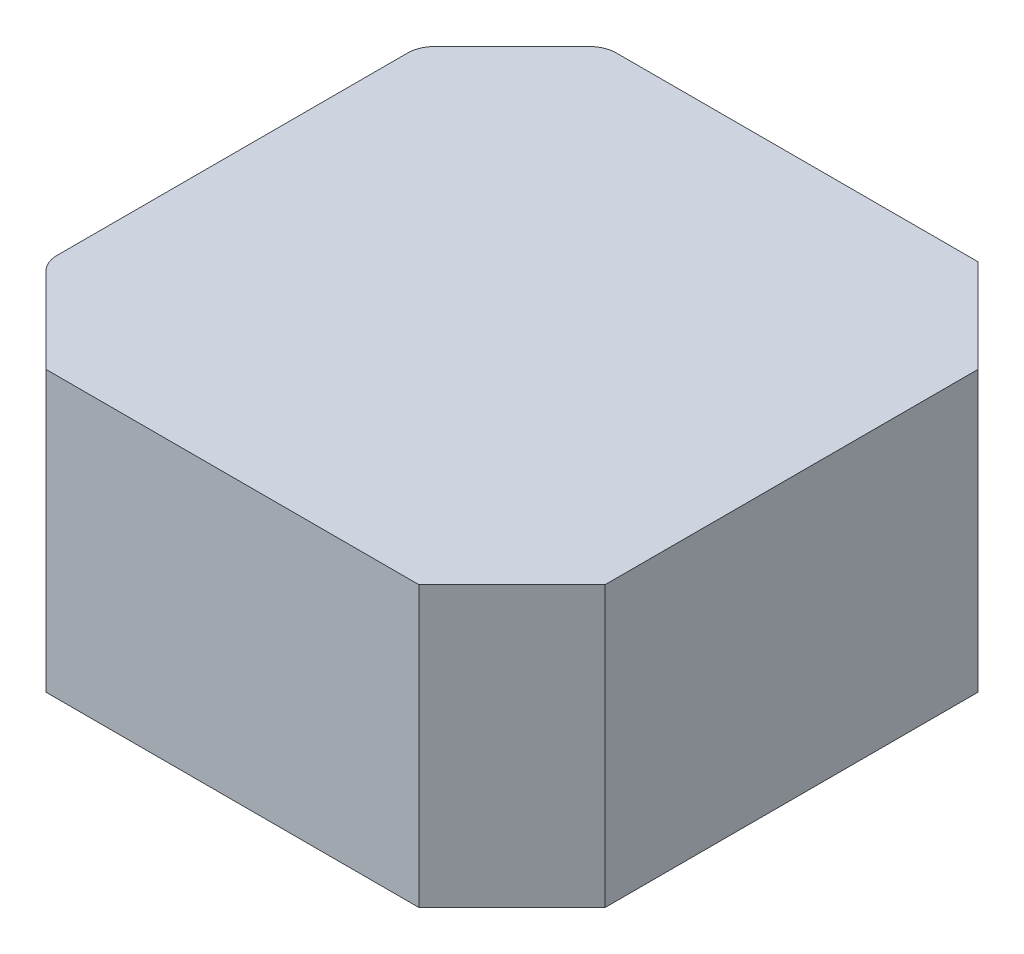
ISO-10303-21;
HEADER;
FILE_DESCRIPTION(('STEP AP214'),'2;1');
FILE_NAME('part.step','',(''),(''),'','','');
FILE_SCHEMA(('AUTOMOTIVE_DESIGN { 1 0 10303 214 1 1 1 1 }'));
ENDSEC;
DATA;
#1=APPLICATION_CONTEXT('core data for automotive mechanical design processes');
#2=APPLICATION_PROTOCOL_DEFINITION('international standard','automotive_design',2000,#1);
#3=PRODUCT_CONTEXT('',#1,'mechanical');
#4=PRODUCT('Part','Part','',(#3));
#5=PRODUCT_RELATED_PRODUCT_CATEGORY('part','',(#4));
#6=PRODUCT_DEFINITION_FORMATION('','',#4);
#7=PRODUCT_DEFINITION_CONTEXT('part definition',#1,'design');
#8=PRODUCT_DEFINITION('design','',#6,#7);
#9=PRODUCT_DEFINITION_SHAPE('','',#8);
#10=(LENGTH_UNIT() NAMED_UNIT(*) SI_UNIT(.MILLI.,.METRE.));
#11=(NAMED_UNIT(*) PLANE_ANGLE_UNIT() SI_UNIT($,.RADIAN.));
#12=(NAMED_UNIT(*) SI_UNIT($,.STERADIAN.) SOLID_ANGLE_UNIT());
#13=UNCERTAINTY_MEASURE_WITH_UNIT(LENGTH_MEASURE(1.E-05),#10,'distance_accuracy_value','');
#14=(GEOMETRIC_REPRESENTATION_CONTEXT(3) GLOBAL_UNCERTAINTY_ASSIGNED_CONTEXT((#13)) GLOBAL_UNIT_ASSIGNED_CONTEXT((#10,
#11,#12)) REPRESENTATION_CONTEXT('',''));
#15=CARTESIAN_POINT('',(0.,0.,0.));
#16=DIRECTION('',(0.,0.,1.));
#17=DIRECTION('',(1.,0.,0.));
#18=AXIS2_PLACEMENT_3D('',#15,#16,#17);
#19=CARTESIAN_POINT('',(-21.,21.,-21.));
#20=DIRECTION('',(1.,0.,0.));
#21=DIRECTION('',(0.,0.,-1.));
#22=AXIS2_PLACEMENT_3D('',#19,#20,#21);
#23=PLANE('',#22);
#24=DIRECTION('',(0.,0.,1.));
#25=VECTOR('',#24,1.);
#26=CARTESIAN_POINT('',(-21.,21.,-21.));
#27=LINE('',#26,#25);
#28=CARTESIAN_POINT('',(-21.,21.,-13.1715728752538));
#29=VERTEX_POINT('',#28);
#30=CARTESIAN_POINT('',(-21.,21.,13.1715728752538));
#31=VERTEX_POINT('',#30);
#32=EDGE_CURVE('E143',#29,#31,#27,.T.);
#33=ORIENTED_EDGE('',*,*,#32,.F.);
#34=DIRECTION('',(0.,1.,0.));
#35=VECTOR('',#34,1.);
#36=CARTESIAN_POINT('',(-21.,0.,-13.1715728752538));
#37=LINE('',#36,#35);
#38=CARTESIAN_POINT('',(-21.,0.,-13.1715728752538));
#39=VERTEX_POINT('',#38);
#40=EDGE_CURVE('E41',#29,#39,#37,.F.);
#41=ORIENTED_EDGE('',*,*,#40,.T.);
#42=DIRECTION('',(0.,0.,1.));
#43=VECTOR('',#42,1.);
#44=CARTESIAN_POINT('',(-21.,0.,-21.));
#45=LINE('',#44,#43);
#46=CARTESIAN_POINT('',(-21.,0.,13.1715728752538));
#47=VERTEX_POINT('',#46);
#48=EDGE_CURVE('E196',#39,#47,#45,.T.);
#49=ORIENTED_EDGE('',*,*,#48,.T.);
#50=DIRECTION('',(0.,-1.,0.));
#51=VECTOR('',#50,1.);
#52=CARTESIAN_POINT('',(-21.,21.,13.1715728752538));
#53=LINE('',#52,#51);
#54=EDGE_CURVE('E190',#47,#31,#53,.F.);
#55=ORIENTED_EDGE('',*,*,#54,.T.);
#56=EDGE_LOOP('',(#33,#41,#49,#55));
#57=FACE_BOUND('',#56,.T.);
#58=ADVANCED_FACE('F33',(#57),#23,.F.);
#59=CARTESIAN_POINT('',(-21.,21.,21.));
#60=DIRECTION('',(0.,0.,-1.));
#61=DIRECTION('',(-1.,0.,0.));
#62=AXIS2_PLACEMENT_3D('',#59,#60,#61);
#63=PLANE('',#62);
#64=DIRECTION('',(1.,0.,0.));
#65=VECTOR('',#64,1.);
#66=CARTESIAN_POINT('',(-21.,21.,21.));
#67=LINE('',#66,#65);
#68=CARTESIAN_POINT('',(-14.,21.,21.));
#69=VERTEX_POINT('',#68);
#70=CARTESIAN_POINT('',(14.,21.,21.));
#71=VERTEX_POINT('',#70);
#72=EDGE_CURVE('E147',#69,#71,#67,.T.);
#73=ORIENTED_EDGE('',*,*,#72,.F.);
#74=DIRECTION('',(0.,-1.,0.));
#75=VECTOR('',#74,1.);
#76=CARTESIAN_POINT('',(-14.,21.,21.));
#77=LINE('',#76,#75);
#78=CARTESIAN_POINT('',(-14.,0.,21.));
#79=VERTEX_POINT('',#78);
#80=EDGE_CURVE('E167',#69,#79,#77,.T.);
#81=ORIENTED_EDGE('',*,*,#80,.T.);
#82=DIRECTION('',(1.,0.,0.));
#83=VECTOR('',#82,1.);
#84=CARTESIAN_POINT('',(-21.,0.,21.));
#85=LINE('',#84,#83);
#86=CARTESIAN_POINT('',(14.,0.,21.));
#87=VERTEX_POINT('',#86);
#88=EDGE_CURVE('E149',#79,#87,#85,.T.);
#89=ORIENTED_EDGE('',*,*,#88,.T.);
#90=DIRECTION('',(0.,1.,0.));
#91=VECTOR('',#90,1.);
#92=CARTESIAN_POINT('',(14.,21.,21.));
#93=LINE('',#92,#91);
#94=EDGE_CURVE('E165',#87,#71,#93,.T.);
#95=ORIENTED_EDGE('',*,*,#94,.T.);
#96=EDGE_LOOP('',(#73,#81,#89,#95));
#97=FACE_BOUND('',#96,.T.);
#98=ADVANCED_FACE('F223',(#97),#63,.F.);
#99=CARTESIAN_POINT('',(21.,21.,-21.));
#100=DIRECTION('',(-1.,0.,0.));
#101=DIRECTION('',(0.,0.,1.));
#102=AXIS2_PLACEMENT_3D('',#99,#100,#101);
#103=PLANE('',#102);
#104=DIRECTION('',(0.,0.,-1.));
#105=VECTOR('',#104,1.);
#106=CARTESIAN_POINT('',(21.,21.,-21.));
#107=LINE('',#106,#105);
#108=CARTESIAN_POINT('',(21.,21.,14.));
#109=VERTEX_POINT('',#108);
#110=CARTESIAN_POINT('',(21.,21.,-14.));
#111=VERTEX_POINT('',#110);
#112=EDGE_CURVE('E205',#109,#111,#107,.T.);
#113=ORIENTED_EDGE('',*,*,#112,.F.);
#114=DIRECTION('',(0.,-1.,0.));
#115=VECTOR('',#114,1.);
#116=CARTESIAN_POINT('',(21.,21.,14.));
#117=LINE('',#116,#115);
#118=CARTESIAN_POINT('',(21.,0.,14.));
#119=VERTEX_POINT('',#118);
#120=EDGE_CURVE('E171',#109,#119,#117,.T.);
#121=ORIENTED_EDGE('',*,*,#120,.T.);
#122=DIRECTION('',(0.,0.,-1.));
#123=VECTOR('',#122,1.);
#124=CARTESIAN_POINT('',(21.,0.,-21.));
#125=LINE('',#124,#123);
#126=CARTESIAN_POINT('',(21.,0.,-14.));
#127=VERTEX_POINT('',#126);
#128=EDGE_CURVE('E144',#119,#127,#125,.T.);
#129=ORIENTED_EDGE('',*,*,#128,.T.);
#130=DIRECTION('',(0.,1.,0.));
#131=VECTOR('',#130,1.);
#132=CARTESIAN_POINT('',(21.,21.,-14.));
#133=LINE('',#132,#131);
#134=EDGE_CURVE('E121',#127,#111,#133,.T.);
#135=ORIENTED_EDGE('',*,*,#134,.T.);
#136=EDGE_LOOP('',(#113,#121,#129,#135));
#137=FACE_BOUND('',#136,.T.);
#138=ADVANCED_FACE('F221',(#137),#103,.F.);
#139=CARTESIAN_POINT('',(-21.,21.,-21.));
#140=DIRECTION('',(0.,0.,1.));
#141=DIRECTION('',(1.,0.,0.));
#142=AXIS2_PLACEMENT_3D('',#139,#140,#141);
#143=PLANE('',#142);
#144=DIRECTION('',(-1.,0.,0.));
#145=VECTOR('',#144,1.);
#146=CARTESIAN_POINT('',(-21.,0.,-21.));
#147=LINE('',#146,#145);
#148=CARTESIAN_POINT('',(14.,0.,-21.));
#149=VERTEX_POINT('',#148);
#150=CARTESIAN_POINT('',(-13.1715728752538,0.,-21.));
#151=VERTEX_POINT('',#150);
#152=EDGE_CURVE('E133',#149,#151,#147,.T.);
#153=ORIENTED_EDGE('',*,*,#152,.T.);
#154=DIRECTION('',(0.,-1.,0.));
#155=VECTOR('',#154,1.);
#156=CARTESIAN_POINT('',(-13.1715728752538,21.,-21.));
#157=LINE('',#156,#155);
#158=CARTESIAN_POINT('',(-13.1715728752538,21.,-21.));
#159=VERTEX_POINT('',#158);
#160=EDGE_CURVE('E174',#151,#159,#157,.F.);
#161=ORIENTED_EDGE('',*,*,#160,.T.);
#162=DIRECTION('',(-1.,0.,0.));
#163=VECTOR('',#162,1.);
#164=CARTESIAN_POINT('',(-21.,21.,-21.));
#165=LINE('',#164,#163);
#166=CARTESIAN_POINT('',(14.,21.,-21.));
#167=VERTEX_POINT('',#166);
#168=EDGE_CURVE('E126',#167,#159,#165,.T.);
#169=ORIENTED_EDGE('',*,*,#168,.F.);
#170=DIRECTION('',(0.,-1.,0.));
#171=VECTOR('',#170,1.);
#172=CARTESIAN_POINT('',(14.,21.,-21.));
#173=LINE('',#172,#171);
#174=EDGE_CURVE('E120',#167,#149,#173,.T.);
#175=ORIENTED_EDGE('',*,*,#174,.T.);
#176=EDGE_LOOP('',(#153,#161,#169,#175));
#177=FACE_BOUND('',#176,.T.);
#178=ADVANCED_FACE('F131',(#177),#143,.F.);
#179=CARTESIAN_POINT('',(-21.,21.,21.));
#180=DIRECTION('',(0.,1.,0.));
#181=DIRECTION('',(0.,0.,1.));
#182=AXIS2_PLACEMENT_3D('',#179,#180,#181);
#183=PLANE('',#182);
#184=ORIENTED_EDGE('',*,*,#168,.T.);
#185=CARTESIAN_POINT('',(-13.1715728752538,21.,-19.));
#186=DIRECTION('',(0.,1.,0.));
#187=DIRECTION('',(0.,0.,1.));
#188=AXIS2_PLACEMENT_3D('',#185,#186,#187);
#189=CIRCLE('',#188,2.);
#190=CARTESIAN_POINT('',(-14.5857864376269,21.,-20.4142135623731));
#191=VERTEX_POINT('',#190);
#192=EDGE_CURVE('E180',#159,#191,#189,.T.);
#193=ORIENTED_EDGE('',*,*,#192,.T.);
#194=DIRECTION('',(0.707106781186549,0.,-0.707106781186546));
#195=VECTOR('',#194,1.);
#196=CARTESIAN_POINT('',(-38.5,21.,3.49999999999993));
#197=LINE('',#196,#195);
#198=CARTESIAN_POINT('',(-20.4142135623731,21.,-14.5857864376269));
#199=VERTEX_POINT('',#198);
#200=EDGE_CURVE('E162',#191,#199,#197,.F.);
#201=ORIENTED_EDGE('',*,*,#200,.T.);
#202=CARTESIAN_POINT('',(-19.,21.,-13.1715728752538));
#203=DIRECTION('',(0.,1.,0.));
#204=DIRECTION('',(0.,0.,1.));
#205=AXIS2_PLACEMENT_3D('',#202,#203,#204);
#206=CIRCLE('',#205,2.);
#207=EDGE_CURVE('E178',#199,#29,#206,.T.);
#208=ORIENTED_EDGE('',*,*,#207,.T.);
#209=ORIENTED_EDGE('',*,*,#32,.T.);
#210=CARTESIAN_POINT('',(-19.,21.,13.1715728752538));
#211=DIRECTION('',(0.,1.,0.));
#212=DIRECTION('',(0.,0.,1.));
#213=AXIS2_PLACEMENT_3D('',#210,#211,#212);
#214=CIRCLE('',#213,2.);
#215=CARTESIAN_POINT('',(-20.4142135623731,21.,14.5857864376269));
#216=VERTEX_POINT('',#215);
#217=EDGE_CURVE('E176',#31,#216,#214,.T.);
#218=ORIENTED_EDGE('',*,*,#217,.T.);
#219=DIRECTION('',(-0.707106781186546,0.,-0.707106781186549));
#220=VECTOR('',#219,1.);
#221=CARTESIAN_POINT('',(-17.5,21.,17.5));
#222=LINE('',#221,#220);
#223=EDGE_CURVE('E160',#216,#69,#222,.F.);
#224=ORIENTED_EDGE('',*,*,#223,.T.);
#225=ORIENTED_EDGE('',*,*,#72,.T.);
#226=DIRECTION('',(-0.707106781186549,0.,0.707106781186546));
#227=VECTOR('',#226,1.);
#228=CARTESIAN_POINT('',(-3.50000000000008,21.,38.5));
#229=LINE('',#228,#227);
#230=EDGE_CURVE('E158',#71,#109,#229,.F.);
#231=ORIENTED_EDGE('',*,*,#230,.T.);
#232=ORIENTED_EDGE('',*,*,#112,.T.);
#233=DIRECTION('',(0.707106781186546,0.,0.707106781186549));
#234=VECTOR('',#233,1.);
#235=CARTESIAN_POINT('',(17.5000000000001,21.,-17.4999999999999));
#236=LINE('',#235,#234);
#237=EDGE_CURVE('E136',#111,#167,#236,.F.);
#238=ORIENTED_EDGE('',*,*,#237,.T.);
#239=EDGE_LOOP('',(#184,#193,#201,#208,#209,#218,#224,#225,#231,#232,#238));
#240=FACE_BOUND('',#239,.T.);
#241=ADVANCED_FACE('F212',(#240),#183,.T.);
#242=CARTESIAN_POINT('',(-21.,0.,21.));
#243=DIRECTION('',(0.,1.,0.));
#244=DIRECTION('',(0.,0.,1.));
#245=AXIS2_PLACEMENT_3D('',#242,#243,#244);
#246=PLANE('',#245);
#247=DIRECTION('',(-0.707106781186549,0.,0.707106781186546));
#248=VECTOR('',#247,1.);
#249=CARTESIAN_POINT('',(-21.,0.,-14.));
#250=LINE('',#249,#248);
#251=CARTESIAN_POINT('',(-20.4142135623731,0.,-14.5857864376269));
#252=VERTEX_POINT('',#251);
#253=CARTESIAN_POINT('',(-14.5857864376269,0.,-20.4142135623731));
#254=VERTEX_POINT('',#253);
#255=EDGE_CURVE('E137',#252,#254,#250,.F.);
#256=ORIENTED_EDGE('',*,*,#255,.T.);
#257=CARTESIAN_POINT('',(-13.1715728752538,0.,-19.));
#258=DIRECTION('',(0.,1.,0.));
#259=DIRECTION('',(0.,0.,1.));
#260=AXIS2_PLACEMENT_3D('',#257,#258,#259);
#261=CIRCLE('',#260,2.);
#262=EDGE_CURVE('E142',#254,#151,#261,.F.);
#263=ORIENTED_EDGE('',*,*,#262,.T.);
#264=ORIENTED_EDGE('',*,*,#152,.F.);
#265=DIRECTION('',(-0.707106781186546,0.,-0.707106781186549));
#266=VECTOR('',#265,1.);
#267=CARTESIAN_POINT('',(14.,0.,-21.));
#268=LINE('',#267,#266);
#269=EDGE_CURVE('E116',#149,#127,#268,.F.);
#270=ORIENTED_EDGE('',*,*,#269,.T.);
#271=ORIENTED_EDGE('',*,*,#128,.F.);
#272=DIRECTION('',(0.707106781186549,0.,-0.707106781186546));
#273=VECTOR('',#272,1.);
#274=CARTESIAN_POINT('',(21.,0.,14.));
#275=LINE('',#274,#273);
#276=EDGE_CURVE('E125',#119,#87,#275,.F.);
#277=ORIENTED_EDGE('',*,*,#276,.T.);
#278=ORIENTED_EDGE('',*,*,#88,.F.);
#279=DIRECTION('',(0.707106781186546,0.,0.707106781186549));
#280=VECTOR('',#279,1.);
#281=CARTESIAN_POINT('',(-14.,0.,21.));
#282=LINE('',#281,#280);
#283=CARTESIAN_POINT('',(-20.4142135623731,0.,14.5857864376269));
#284=VERTEX_POINT('',#283);
#285=EDGE_CURVE('E154',#79,#284,#282,.F.);
#286=ORIENTED_EDGE('',*,*,#285,.T.);
#287=CARTESIAN_POINT('',(-19.,0.,13.1715728752538));
#288=DIRECTION('',(0.,1.,0.));
#289=DIRECTION('',(0.,0.,1.));
#290=AXIS2_PLACEMENT_3D('',#287,#288,#289);
#291=CIRCLE('',#290,2.);
#292=EDGE_CURVE('E53',#284,#47,#291,.F.);
#293=ORIENTED_EDGE('',*,*,#292,.T.);
#294=ORIENTED_EDGE('',*,*,#48,.F.);
#295=CARTESIAN_POINT('',(-19.,0.,-13.1715728752538));
#296=DIRECTION('',(0.,1.,0.));
#297=DIRECTION('',(0.,0.,1.));
#298=AXIS2_PLACEMENT_3D('',#295,#296,#297);
#299=CIRCLE('',#298,2.);
#300=EDGE_CURVE('E187',#39,#252,#299,.F.);
#301=ORIENTED_EDGE('',*,*,#300,.T.);
#302=EDGE_LOOP('',(#256,#263,#264,#270,#271,#277,#278,#286,#293,#294,#301));
#303=FACE_BOUND('',#302,.T.);
#304=ADVANCED_FACE('F140',(#303),#246,.F.);
#305=CARTESIAN_POINT('',(-21.,21.,-14.));
#306=DIRECTION('',(0.707106781186546,0.,0.707106781186549));
#307=DIRECTION('',(0.707106781186549,0.,-0.707106781186546));
#308=AXIS2_PLACEMENT_3D('',#305,#306,#307);
#309=PLANE('',#308);
#310=ORIENTED_EDGE('',*,*,#200,.F.);
#311=DIRECTION('',(0.,1.,0.));
#312=VECTOR('',#311,1.);
#313=CARTESIAN_POINT('',(-14.5857864376269,0.,-20.4142135623731));
#314=LINE('',#313,#312);
#315=EDGE_CURVE('E184',#191,#254,#314,.F.);
#316=ORIENTED_EDGE('',*,*,#315,.T.);
#317=ORIENTED_EDGE('',*,*,#255,.F.);
#318=DIRECTION('',(0.,-1.,0.));
#319=VECTOR('',#318,1.);
#320=CARTESIAN_POINT('',(-20.4142135623731,21.,-14.5857864376269));
#321=LINE('',#320,#319);
#322=EDGE_CURVE('E182',#252,#199,#321,.F.);
#323=ORIENTED_EDGE('',*,*,#322,.T.);
#324=EDGE_LOOP('',(#310,#316,#317,#323));
#325=FACE_BOUND('',#324,.T.);
#326=ADVANCED_FACE('F230',(#325),#309,.F.);
#327=CARTESIAN_POINT('',(-14.,21.,21.));
#328=DIRECTION('',(0.707106781186549,0.,-0.707106781186546));
#329=DIRECTION('',(-0.707106781186546,0.,-0.707106781186549));
#330=AXIS2_PLACEMENT_3D('',#327,#328,#329);
#331=PLANE('',#330);
#332=ORIENTED_EDGE('',*,*,#223,.F.);
#333=DIRECTION('',(0.,1.,0.));
#334=VECTOR('',#333,1.);
#335=CARTESIAN_POINT('',(-20.4142135623731,0.,14.5857864376269));
#336=LINE('',#335,#334);
#337=EDGE_CURVE('E11',#216,#284,#336,.F.);
#338=ORIENTED_EDGE('',*,*,#337,.T.);
#339=ORIENTED_EDGE('',*,*,#285,.F.);
#340=ORIENTED_EDGE('',*,*,#80,.F.);
#341=EDGE_LOOP('',(#332,#338,#339,#340));
#342=FACE_BOUND('',#341,.T.);
#343=ADVANCED_FACE('F224',(#342),#331,.F.);
#344=CARTESIAN_POINT('',(21.,21.,14.));
#345=DIRECTION('',(-0.707106781186546,0.,-0.707106781186549));
#346=DIRECTION('',(-0.707106781186549,0.,0.707106781186546));
#347=AXIS2_PLACEMENT_3D('',#344,#345,#346);
#348=PLANE('',#347);
#349=ORIENTED_EDGE('',*,*,#230,.F.);
#350=ORIENTED_EDGE('',*,*,#94,.F.);
#351=ORIENTED_EDGE('',*,*,#276,.F.);
#352=ORIENTED_EDGE('',*,*,#120,.F.);
#353=EDGE_LOOP('',(#349,#350,#351,#352));
#354=FACE_BOUND('',#353,.T.);
#355=ADVANCED_FACE('F219',(#354),#348,.F.);
#356=CARTESIAN_POINT('',(14.,21.,-21.));
#357=DIRECTION('',(-0.707106781186549,0.,0.707106781186546));
#358=DIRECTION('',(0.707106781186546,0.,0.707106781186549));
#359=AXIS2_PLACEMENT_3D('',#356,#357,#358);
#360=PLANE('',#359);
#361=ORIENTED_EDGE('',*,*,#237,.F.);
#362=ORIENTED_EDGE('',*,*,#134,.F.);
#363=ORIENTED_EDGE('',*,*,#269,.F.);
#364=ORIENTED_EDGE('',*,*,#174,.F.);
#365=EDGE_LOOP('',(#361,#362,#363,#364));
#366=FACE_BOUND('',#365,.T.);
#367=ADVANCED_FACE('F119',(#366),#360,.F.);
#368=CARTESIAN_POINT('',(-13.1715728752538,21.,-19.));
#369=DIRECTION('',(0.,1.,0.));
#370=DIRECTION('',(0.,0.,1.));
#371=AXIS2_PLACEMENT_3D('',#368,#369,#370);
#372=CYLINDRICAL_SURFACE('',#371,2.);
#373=ORIENTED_EDGE('',*,*,#262,.F.);
#374=ORIENTED_EDGE('',*,*,#315,.F.);
#375=ORIENTED_EDGE('',*,*,#192,.F.);
#376=ORIENTED_EDGE('',*,*,#160,.F.);
#377=EDGE_LOOP('',(#373,#374,#375,#376));
#378=FACE_BOUND('',#377,.T.);
#379=ADVANCED_FACE('F233',(#378),#372,.T.);
#380=CARTESIAN_POINT('',(-19.,21.,-13.1715728752538));
#381=DIRECTION('',(0.,-1.,0.));
#382=DIRECTION('',(0.,0.,-1.));
#383=AXIS2_PLACEMENT_3D('',#380,#381,#382);
#384=CYLINDRICAL_SURFACE('',#383,2.);
#385=ORIENTED_EDGE('',*,*,#207,.F.);
#386=ORIENTED_EDGE('',*,*,#322,.F.);
#387=ORIENTED_EDGE('',*,*,#300,.F.);
#388=ORIENTED_EDGE('',*,*,#40,.F.);
#389=EDGE_LOOP('',(#385,#386,#387,#388));
#390=FACE_BOUND('',#389,.T.);
#391=ADVANCED_FACE('F228',(#390),#384,.T.);
#392=CARTESIAN_POINT('',(-19.,21.,13.1715728752538));
#393=DIRECTION('',(0.,1.,0.));
#394=DIRECTION('',(0.,0.,1.));
#395=AXIS2_PLACEMENT_3D('',#392,#393,#394);
#396=CYLINDRICAL_SURFACE('',#395,2.);
#397=ORIENTED_EDGE('',*,*,#292,.F.);
#398=ORIENTED_EDGE('',*,*,#337,.F.);
#399=ORIENTED_EDGE('',*,*,#217,.F.);
#400=ORIENTED_EDGE('',*,*,#54,.F.);
#401=EDGE_LOOP('',(#397,#398,#399,#400));
#402=FACE_BOUND('',#401,.T.);
#403=ADVANCED_FACE('F35',(#402),#396,.T.);
#404=CLOSED_SHELL('',(#58,#98,#138,#178,#241,#304,#326,#343,#355,#367,#379,#391,#403));
#405=MANIFOLD_SOLID_BREP('B2',#404);
#406=ADVANCED_BREP_SHAPE_REPRESENTATION('',(#18,#405),#14);
#407=SHAPE_DEFINITION_REPRESENTATION(#9,#406);
ENDSEC;
END-ISO-10303-21;
